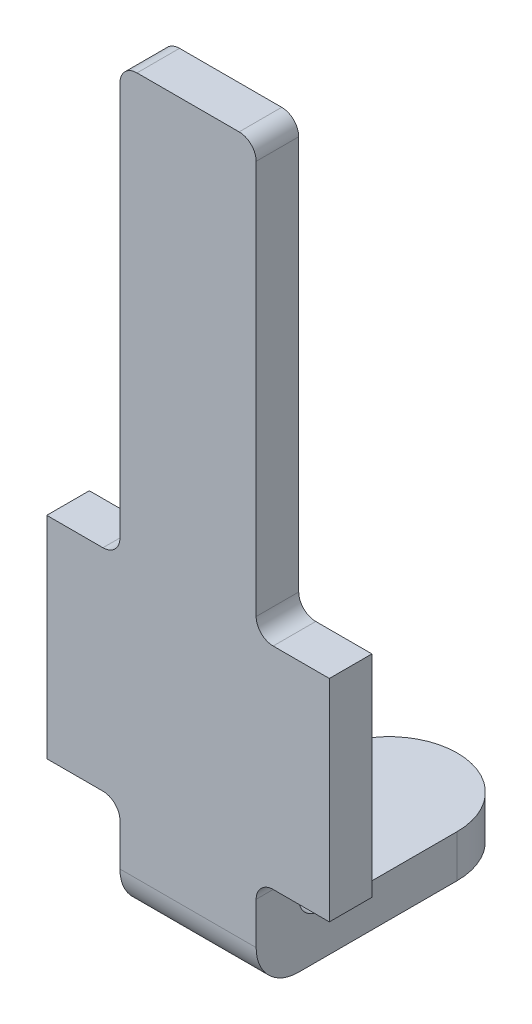
ISO-10303-21;
HEADER;
FILE_DESCRIPTION(('STEP AP214'),'2;1');
FILE_NAME('part.step','',(''),(''),'','','');
FILE_SCHEMA(('AUTOMOTIVE_DESIGN { 1 0 10303 214 1 1 1 1 }'));
ENDSEC;
DATA;
#1=APPLICATION_CONTEXT('core data for automotive mechanical design processes');
#2=APPLICATION_PROTOCOL_DEFINITION('international standard','automotive_design',2000,#1);
#3=PRODUCT_CONTEXT('',#1,'mechanical');
#4=PRODUCT('Part','Part','',(#3));
#5=PRODUCT_RELATED_PRODUCT_CATEGORY('part','',(#4));
#6=PRODUCT_DEFINITION_FORMATION('','',#4);
#7=PRODUCT_DEFINITION_CONTEXT('part definition',#1,'design');
#8=PRODUCT_DEFINITION('design','',#6,#7);
#9=PRODUCT_DEFINITION_SHAPE('','',#8);
#10=(LENGTH_UNIT() NAMED_UNIT(*) SI_UNIT(.MILLI.,.METRE.));
#11=(NAMED_UNIT(*) PLANE_ANGLE_UNIT() SI_UNIT($,.RADIAN.));
#12=(NAMED_UNIT(*) SI_UNIT($,.STERADIAN.) SOLID_ANGLE_UNIT());
#13=UNCERTAINTY_MEASURE_WITH_UNIT(LENGTH_MEASURE(1.E-05),#10,'distance_accuracy_value','');
#14=(GEOMETRIC_REPRESENTATION_CONTEXT(3) GLOBAL_UNCERTAINTY_ASSIGNED_CONTEXT((#13)) GLOBAL_UNIT_ASSIGNED_CONTEXT((#10,
#11,#12)) REPRESENTATION_CONTEXT('',''));
#15=CARTESIAN_POINT('',(0.,0.,0.));
#16=DIRECTION('',(0.,0.,1.));
#17=DIRECTION('',(1.,0.,0.));
#18=AXIS2_PLACEMENT_3D('',#15,#16,#17);
#19=CARTESIAN_POINT('',(-14.47,1.48437551370885,-0.748999999999983));
#20=DIRECTION('',(0.,0.,-1.));
#21=DIRECTION('',(1.,0.,0.));
#22=AXIS2_PLACEMENT_3D('',#19,#20,#21);
#23=CYLINDRICAL_SURFACE('',#22,0.1);
#24=CARTESIAN_POINT('',(-14.47,1.48437551370885,-0.498999999999983));
#25=DIRECTION('',(0.,0.,1.));
#26=DIRECTION('',(1.,0.,0.));
#27=AXIS2_PLACEMENT_3D('',#24,#25,#26);
#28=CIRCLE('',#27,0.1);
#29=CARTESIAN_POINT('',(-14.47,1.38437551370885,-0.499000000000012));
#30=VERTEX_POINT('',#29);
#31=CARTESIAN_POINT('',(-14.37,1.48437551370885,-0.498999999999983));
#32=VERTEX_POINT('',#31);
#33=EDGE_CURVE('E186',#30,#32,#28,.T.);
#34=ORIENTED_EDGE('',*,*,#33,.T.);
#35=DIRECTION('',(0.,0.,-1.));
#36=VECTOR('',#35,1.);
#37=CARTESIAN_POINT('',(-14.37,1.48437551370885,-0.748999999999983));
#38=LINE('',#37,#36);
#39=CARTESIAN_POINT('',(-14.37,1.48437551370885,-0.748999999999983));
#40=VERTEX_POINT('',#39);
#41=EDGE_CURVE('E190',#32,#40,#38,.T.);
#42=ORIENTED_EDGE('',*,*,#41,.T.);
#43=CARTESIAN_POINT('',(-14.47,1.48437551370885,-0.748999999999983));
#44=DIRECTION('',(0.,0.,-1.));
#45=DIRECTION('',(-1.,0.,0.));
#46=AXIS2_PLACEMENT_3D('',#43,#44,#45);
#47=CIRCLE('',#46,0.1);
#48=CARTESIAN_POINT('',(-14.47,1.38437551370885,-0.749000000000012));
#49=VERTEX_POINT('',#48);
#50=EDGE_CURVE('E272',#40,#49,#47,.T.);
#51=ORIENTED_EDGE('',*,*,#50,.T.);
#52=DIRECTION('',(0.,0.,1.));
#53=VECTOR('',#52,1.);
#54=CARTESIAN_POINT('',(-14.47,1.38437551370885,-0.749000000000012));
#55=LINE('',#54,#53);
#56=EDGE_CURVE('E194',#49,#30,#55,.T.);
#57=ORIENTED_EDGE('',*,*,#56,.T.);
#58=EDGE_LOOP('',(#34,#42,#51,#57));
#59=FACE_BOUND('',#58,.T.);
#60=ADVANCED_FACE('F16',(#59),#23,.F.);
#61=CARTESIAN_POINT('',(-13.47,1.48437551370885,-0.749000000000014));
#62=DIRECTION('',(0.,0.,1.));
#63=DIRECTION('',(-1.,0.,0.));
#64=AXIS2_PLACEMENT_3D('',#61,#62,#63);
#65=CYLINDRICAL_SURFACE('',#64,0.1);
#66=CARTESIAN_POINT('',(-13.47,1.48437551370885,-0.498999999999985));
#67=DIRECTION('',(0.,0.,1.));
#68=DIRECTION('',(1.,0.,0.));
#69=AXIS2_PLACEMENT_3D('',#66,#67,#68);
#70=CIRCLE('',#69,0.1);
#71=CARTESIAN_POINT('',(-13.57,1.48437551370885,-0.498999999999984));
#72=VERTEX_POINT('',#71);
#73=CARTESIAN_POINT('',(-13.47,1.38437551370885,-0.499000000000013));
#74=VERTEX_POINT('',#73);
#75=EDGE_CURVE('E229',#72,#74,#70,.T.);
#76=ORIENTED_EDGE('',*,*,#75,.T.);
#77=DIRECTION('',(0.,0.,-1.));
#78=VECTOR('',#77,1.);
#79=CARTESIAN_POINT('',(-13.47,1.38437551370885,-0.748999999999984));
#80=LINE('',#79,#78);
#81=CARTESIAN_POINT('',(-13.47,1.38437551370885,-0.749000000000014));
#82=VERTEX_POINT('',#81);
#83=EDGE_CURVE('E42',#74,#82,#80,.T.);
#84=ORIENTED_EDGE('',*,*,#83,.T.);
#85=CARTESIAN_POINT('',(-13.47,1.48437551370885,-0.748999999999984));
#86=DIRECTION('',(0.,0.,-1.));
#87=DIRECTION('',(-1.,0.,0.));
#88=AXIS2_PLACEMENT_3D('',#85,#86,#87);
#89=CIRCLE('',#88,0.1);
#90=CARTESIAN_POINT('',(-13.57,1.48437551370885,-0.748999999999984));
#91=VERTEX_POINT('',#90);
#92=EDGE_CURVE('E298',#82,#91,#89,.T.);
#93=ORIENTED_EDGE('',*,*,#92,.T.);
#94=DIRECTION('',(0.,0.,1.));
#95=VECTOR('',#94,1.);
#96=CARTESIAN_POINT('',(-13.57,1.48437551370885,-0.498999999999984));
#97=LINE('',#96,#95);
#98=EDGE_CURVE('E237',#91,#72,#97,.T.);
#99=ORIENTED_EDGE('',*,*,#98,.T.);
#100=EDGE_LOOP('',(#76,#84,#93,#99));
#101=FACE_BOUND('',#100,.T.);
#102=ADVANCED_FACE('F684',(#101),#65,.F.);
#103=CARTESIAN_POINT('',(-14.47,0.0459658151929143,-0.749000000000012));
#104=DIRECTION('',(0.,0.,1.));
#105=DIRECTION('',(-1.,0.,0.));
#106=AXIS2_PLACEMENT_3D('',#103,#104,#105);
#107=CYLINDRICAL_SURFACE('',#106,0.1);
#108=CARTESIAN_POINT('',(-14.47,0.0459658151929143,-0.498999999999983));
#109=DIRECTION('',(0.,0.,1.));
#110=DIRECTION('',(1.,0.,0.));
#111=AXIS2_PLACEMENT_3D('',#108,#109,#110);
#112=CIRCLE('',#111,0.1);
#113=CARTESIAN_POINT('',(-14.37,0.0459658151929143,-0.498999999999983));
#114=VERTEX_POINT('',#113);
#115=CARTESIAN_POINT('',(-14.47,0.145965815192914,-0.499000000000012));
#116=VERTEX_POINT('',#115);
#117=EDGE_CURVE('E259',#114,#116,#112,.T.);
#118=ORIENTED_EDGE('',*,*,#117,.T.);
#119=DIRECTION('',(0.,0.,-1.));
#120=VECTOR('',#119,1.);
#121=CARTESIAN_POINT('',(-14.47,0.145965815192914,-0.748999999999983));
#122=LINE('',#121,#120);
#123=CARTESIAN_POINT('',(-14.47,0.145965815192914,-0.749000000000012));
#124=VERTEX_POINT('',#123);
#125=EDGE_CURVE('E135',#116,#124,#122,.T.);
#126=ORIENTED_EDGE('',*,*,#125,.T.);
#127=CARTESIAN_POINT('',(-14.47,0.0459658151929143,-0.748999999999983));
#128=DIRECTION('',(0.,0.,-1.));
#129=DIRECTION('',(-1.,0.,0.));
#130=AXIS2_PLACEMENT_3D('',#127,#128,#129);
#131=CIRCLE('',#130,0.1);
#132=CARTESIAN_POINT('',(-14.37,0.0459658151929143,-0.748999999999983));
#133=VERTEX_POINT('',#132);
#134=EDGE_CURVE('E242',#124,#133,#131,.T.);
#135=ORIENTED_EDGE('',*,*,#134,.T.);
#136=DIRECTION('',(0.,0.,1.));
#137=VECTOR('',#136,1.);
#138=CARTESIAN_POINT('',(-14.37,0.0459658151929143,-0.499000000000012));
#139=LINE('',#138,#137);
#140=EDGE_CURVE('E120',#133,#114,#139,.T.);
#141=ORIENTED_EDGE('',*,*,#140,.T.);
#142=EDGE_LOOP('',(#118,#126,#135,#141));
#143=FACE_BOUND('',#142,.T.);
#144=ADVANCED_FACE('F459',(#143),#107,.F.);
#145=CARTESIAN_POINT('',(-13.47,0.0459658151929143,-0.748999999999984));
#146=DIRECTION('',(0.,0.,-1.));
#147=DIRECTION('',(1.,0.,0.));
#148=AXIS2_PLACEMENT_3D('',#145,#146,#147);
#149=CYLINDRICAL_SURFACE('',#148,0.1);
#150=CARTESIAN_POINT('',(-13.47,0.0459658151929143,-0.498999999999984));
#151=DIRECTION('',(0.,0.,1.));
#152=DIRECTION('',(1.,0.,0.));
#153=AXIS2_PLACEMENT_3D('',#150,#151,#152);
#154=CIRCLE('',#153,0.1);
#155=CARTESIAN_POINT('',(-13.47,0.145965815192914,-0.499000000000013));
#156=VERTEX_POINT('',#155);
#157=CARTESIAN_POINT('',(-13.57,0.0459658151929143,-0.498999999999984));
#158=VERTEX_POINT('',#157);
#159=EDGE_CURVE('E327',#156,#158,#154,.T.);
#160=ORIENTED_EDGE('',*,*,#159,.T.);
#161=DIRECTION('',(0.,0.,-1.));
#162=VECTOR('',#161,1.);
#163=CARTESIAN_POINT('',(-13.57,0.0459658151929143,-0.748999999999984));
#164=LINE('',#163,#162);
#165=CARTESIAN_POINT('',(-13.57,0.0459658151929143,-0.748999999999984));
#166=VERTEX_POINT('',#165);
#167=EDGE_CURVE('E232',#158,#166,#164,.T.);
#168=ORIENTED_EDGE('',*,*,#167,.T.);
#169=CARTESIAN_POINT('',(-13.47,0.0459658151929143,-0.748999999999984));
#170=DIRECTION('',(0.,0.,-1.));
#171=DIRECTION('',(-1.,0.,0.));
#172=AXIS2_PLACEMENT_3D('',#169,#170,#171);
#173=CIRCLE('',#172,0.1);
#174=CARTESIAN_POINT('',(-13.47,0.145965815192914,-0.749000000000013));
#175=VERTEX_POINT('',#174);
#176=EDGE_CURVE('E266',#166,#175,#173,.T.);
#177=ORIENTED_EDGE('',*,*,#176,.T.);
#178=DIRECTION('',(0.,0.,1.));
#179=VECTOR('',#178,1.);
#180=CARTESIAN_POINT('',(-13.47,0.145965815192914,-0.749000000000013));
#181=LINE('',#180,#179);
#182=EDGE_CURVE('E11',#175,#156,#181,.T.);
#183=ORIENTED_EDGE('',*,*,#182,.T.);
#184=EDGE_LOOP('',(#160,#168,#177,#183));
#185=FACE_BOUND('',#184,.T.);
#186=ADVANCED_FACE('F519',(#185),#149,.F.);
#187=CARTESIAN_POINT('',(-14.27,3.8,-0.748999999999983));
#188=DIRECTION('',(0.,0.,1.));
#189=DIRECTION('',(-1.,0.,0.));
#190=AXIS2_PLACEMENT_3D('',#187,#188,#189);
#191=CYLINDRICAL_SURFACE('',#190,0.1);
#192=CARTESIAN_POINT('',(-14.27,3.8,-0.498999999999984));
#193=DIRECTION('',(0.,0.,-1.));
#194=DIRECTION('',(1.,0.,0.));
#195=AXIS2_PLACEMENT_3D('',#192,#193,#194);
#196=CIRCLE('',#195,0.1);
#197=CARTESIAN_POINT('',(-14.37,3.8,-0.498999999999984));
#198=VERTEX_POINT('',#197);
#199=CARTESIAN_POINT('',(-14.27,3.9,-0.498999999999984));
#200=VERTEX_POINT('',#199);
#201=EDGE_CURVE('E200',#198,#200,#196,.T.);
#202=ORIENTED_EDGE('',*,*,#201,.T.);
#203=DIRECTION('',(0.,0.,-1.));
#204=VECTOR('',#203,1.);
#205=CARTESIAN_POINT('',(-14.27,3.9,-0.748999999999983));
#206=LINE('',#205,#204);
#207=CARTESIAN_POINT('',(-14.27,3.9,-0.748999999999983));
#208=VERTEX_POINT('',#207);
#209=EDGE_CURVE('E312',#200,#208,#206,.T.);
#210=ORIENTED_EDGE('',*,*,#209,.T.);
#211=CARTESIAN_POINT('',(-14.27,3.8,-0.748999999999983));
#212=DIRECTION('',(0.,0.,1.));
#213=DIRECTION('',(-1.,0.,0.));
#214=AXIS2_PLACEMENT_3D('',#211,#212,#213);
#215=CIRCLE('',#214,0.1);
#216=CARTESIAN_POINT('',(-14.37,3.8,-0.748999999999983));
#217=VERTEX_POINT('',#216);
#218=EDGE_CURVE('E268',#208,#217,#215,.T.);
#219=ORIENTED_EDGE('',*,*,#218,.T.);
#220=DIRECTION('',(0.,0.,1.));
#221=VECTOR('',#220,1.);
#222=CARTESIAN_POINT('',(-14.37,3.8,-0.498999999999984));
#223=LINE('',#222,#221);
#224=EDGE_CURVE('E209',#217,#198,#223,.T.);
#225=ORIENTED_EDGE('',*,*,#224,.T.);
#226=EDGE_LOOP('',(#202,#210,#219,#225));
#227=FACE_BOUND('',#226,.T.);
#228=ADVANCED_FACE('F693',(#227),#191,.T.);
#229=CARTESIAN_POINT('',(-13.67,3.8,-0.748999999999984));
#230=DIRECTION('',(0.,0.,-1.));
#231=DIRECTION('',(1.,0.,0.));
#232=AXIS2_PLACEMENT_3D('',#229,#230,#231);
#233=CYLINDRICAL_SURFACE('',#232,0.1);
#234=CARTESIAN_POINT('',(-13.67,3.8,-0.498999999999985));
#235=DIRECTION('',(0.,0.,-1.));
#236=DIRECTION('',(1.,0.,0.));
#237=AXIS2_PLACEMENT_3D('',#234,#235,#236);
#238=CIRCLE('',#237,0.1);
#239=CARTESIAN_POINT('',(-13.67,3.9,-0.498999999999985));
#240=VERTEX_POINT('',#239);
#241=CARTESIAN_POINT('',(-13.57,3.8,-0.498999999999985));
#242=VERTEX_POINT('',#241);
#243=EDGE_CURVE('E226',#240,#242,#238,.T.);
#244=ORIENTED_EDGE('',*,*,#243,.T.);
#245=DIRECTION('',(0.,0.,-1.));
#246=VECTOR('',#245,1.);
#247=CARTESIAN_POINT('',(-13.57,3.8,-0.748999999999984));
#248=LINE('',#247,#246);
#249=CARTESIAN_POINT('',(-13.57,3.8,-0.748999999999984));
#250=VERTEX_POINT('',#249);
#251=EDGE_CURVE('E221',#242,#250,#248,.T.);
#252=ORIENTED_EDGE('',*,*,#251,.T.);
#253=CARTESIAN_POINT('',(-13.67,3.8,-0.748999999999984));
#254=DIRECTION('',(0.,0.,1.));
#255=DIRECTION('',(-1.,0.,0.));
#256=AXIS2_PLACEMENT_3D('',#253,#254,#255);
#257=CIRCLE('',#256,0.1);
#258=CARTESIAN_POINT('',(-13.67,3.9,-0.748999999999984));
#259=VERTEX_POINT('',#258);
#260=EDGE_CURVE('E271',#250,#259,#257,.T.);
#261=ORIENTED_EDGE('',*,*,#260,.T.);
#262=DIRECTION('',(0.,0.,1.));
#263=VECTOR('',#262,1.);
#264=CARTESIAN_POINT('',(-13.67,3.9,-0.748999999999984));
#265=LINE('',#264,#263);
#266=EDGE_CURVE('E302',#259,#240,#265,.T.);
#267=ORIENTED_EDGE('',*,*,#266,.T.);
#268=EDGE_LOOP('',(#244,#252,#261,#267));
#269=FACE_BOUND('',#268,.T.);
#270=ADVANCED_FACE('F688',(#269),#233,.T.);
#271=CARTESIAN_POINT('',(-13.14,0.,-1.00308650274883E-13));
#272=DIRECTION('',(-1.,0.,0.));
#273=DIRECTION('',(0.,1.,0.));
#274=AXIS2_PLACEMENT_3D('',#271,#272,#273);
#275=PLANE('',#274);
#276=DIRECTION('',(0.,0.,1.));
#277=VECTOR('',#276,1.);
#278=CARTESIAN_POINT('',(-13.14,1.38437551370885,-0.749000000000014));
#279=LINE('',#278,#277);
#280=CARTESIAN_POINT('',(-13.14,1.38437551370885,-0.749000000000014));
#281=VERTEX_POINT('',#280);
#282=CARTESIAN_POINT('',(-13.14,1.38437551370885,-0.499000000000014));
#283=VERTEX_POINT('',#282);
#284=EDGE_CURVE('E262',#281,#283,#279,.T.);
#285=ORIENTED_EDGE('',*,*,#284,.T.);
#286=DIRECTION('',(0.,-1.,0.));
#287=VECTOR('',#286,1.);
#288=CARTESIAN_POINT('',(-13.14,1.38437551370885,-0.499000000000014));
#289=LINE('',#288,#287);
#290=CARTESIAN_POINT('',(-13.14,0.145965815192914,-0.499000000000014));
#291=VERTEX_POINT('',#290);
#292=EDGE_CURVE('E379',#283,#291,#289,.T.);
#293=ORIENTED_EDGE('',*,*,#292,.T.);
#294=DIRECTION('',(0.,0.,1.));
#295=VECTOR('',#294,1.);
#296=CARTESIAN_POINT('',(-13.14,0.145965815192914,-0.749000000000014));
#297=LINE('',#296,#295);
#298=CARTESIAN_POINT('',(-13.14,0.145965815192914,-0.749000000000014));
#299=VERTEX_POINT('',#298);
#300=EDGE_CURVE('E27',#299,#291,#297,.T.);
#301=ORIENTED_EDGE('',*,*,#300,.F.);
#302=DIRECTION('',(0.,-1.,0.));
#303=VECTOR('',#302,1.);
#304=CARTESIAN_POINT('',(-13.14,1.38437551370885,-0.749000000000014));
#305=LINE('',#304,#303);
#306=EDGE_CURVE('E267',#281,#299,#305,.T.);
#307=ORIENTED_EDGE('',*,*,#306,.F.);
#308=EDGE_LOOP('',(#285,#293,#301,#307));
#309=FACE_BOUND('',#308,.T.);
#310=ADVANCED_FACE('F692',(#309),#275,.F.);
#311=CARTESIAN_POINT('',(-14.8,0.145965815192914,-0.749000000000011));
#312=DIRECTION('',(0.,-1.,0.));
#313=DIRECTION('',(0.,0.,-1.));
#314=AXIS2_PLACEMENT_3D('',#311,#312,#313);
#315=PLANE('',#314);
#316=DIRECTION('',(1.,0.,0.));
#317=VECTOR('',#316,1.);
#318=CARTESIAN_POINT('',(-14.8,0.145965815192914,-0.749000000000011));
#319=LINE('',#318,#317);
#320=EDGE_CURVE('E263',#175,#299,#319,.T.);
#321=ORIENTED_EDGE('',*,*,#320,.T.);
#322=ORIENTED_EDGE('',*,*,#300,.T.);
#323=DIRECTION('',(1.,0.,0.));
#324=VECTOR('',#323,1.);
#325=CARTESIAN_POINT('',(-14.8,0.145965815192914,-0.499000000000011));
#326=LINE('',#325,#324);
#327=EDGE_CURVE('E331',#156,#291,#326,.T.);
#328=ORIENTED_EDGE('',*,*,#327,.F.);
#329=ORIENTED_EDGE('',*,*,#182,.F.);
#330=EDGE_LOOP('',(#321,#322,#328,#329));
#331=FACE_BOUND('',#330,.T.);
#332=ADVANCED_FACE('F525',(#331),#315,.T.);
#333=CARTESIAN_POINT('',(-14.8,1.38437551370885,-0.749000000000012));
#334=DIRECTION('',(0.,-1.,0.));
#335=DIRECTION('',(0.,0.,-1.));
#336=AXIS2_PLACEMENT_3D('',#333,#334,#335);
#337=PLANE('',#336);
#338=DIRECTION('',(1.,0.,0.));
#339=VECTOR('',#338,1.);
#340=CARTESIAN_POINT('',(-14.8,1.38437551370885,-0.499000000000011));
#341=LINE('',#340,#339);
#342=EDGE_CURVE('E376',#74,#283,#341,.T.);
#343=ORIENTED_EDGE('',*,*,#342,.T.);
#344=ORIENTED_EDGE('',*,*,#284,.F.);
#345=DIRECTION('',(1.,0.,0.));
#346=VECTOR('',#345,1.);
#347=CARTESIAN_POINT('',(-14.8,1.38437551370885,-0.749000000000012));
#348=LINE('',#347,#346);
#349=EDGE_CURVE('E301',#82,#281,#348,.T.);
#350=ORIENTED_EDGE('',*,*,#349,.F.);
#351=ORIENTED_EDGE('',*,*,#83,.F.);
#352=EDGE_LOOP('',(#343,#344,#350,#351));
#353=FACE_BOUND('',#352,.T.);
#354=ADVANCED_FACE('F771',(#353),#337,.F.);
#355=CARTESIAN_POINT('',(-14.8,1.38437551370885,-0.749000000000012));
#356=DIRECTION('',(0.,-1.,0.));
#357=DIRECTION('',(0.,0.,-1.));
#358=AXIS2_PLACEMENT_3D('',#355,#356,#357);
#359=PLANE('',#358);
#360=DIRECTION('',(1.,0.,0.));
#361=VECTOR('',#360,1.);
#362=CARTESIAN_POINT('',(-14.8,1.38437551370885,-0.749000000000012));
#363=LINE('',#362,#361);
#364=CARTESIAN_POINT('',(-14.8,1.38437551370885,-0.749000000000012));
#365=VERTEX_POINT('',#364);
#366=EDGE_CURVE('E283',#365,#49,#363,.T.);
#367=ORIENTED_EDGE('',*,*,#366,.F.);
#368=DIRECTION('',(0.,0.,1.));
#369=VECTOR('',#368,1.);
#370=CARTESIAN_POINT('',(-14.8,1.38437551370885,-0.749000000000012));
#371=LINE('',#370,#369);
#372=CARTESIAN_POINT('',(-14.8,1.38437551370885,-0.499000000000011));
#373=VERTEX_POINT('',#372);
#374=EDGE_CURVE('E384',#365,#373,#371,.T.);
#375=ORIENTED_EDGE('',*,*,#374,.T.);
#376=DIRECTION('',(1.,0.,0.));
#377=VECTOR('',#376,1.);
#378=CARTESIAN_POINT('',(-14.8,1.38437551370885,-0.499000000000011));
#379=LINE('',#378,#377);
#380=EDGE_CURVE('E199',#373,#30,#379,.T.);
#381=ORIENTED_EDGE('',*,*,#380,.T.);
#382=ORIENTED_EDGE('',*,*,#56,.F.);
#383=EDGE_LOOP('',(#367,#375,#381,#382));
#384=FACE_BOUND('',#383,.T.);
#385=ADVANCED_FACE('F471',(#384),#359,.F.);
#386=CARTESIAN_POINT('',(-14.8,0.145965815192914,-0.749000000000011));
#387=DIRECTION('',(0.,-1.,0.));
#388=DIRECTION('',(0.,0.,-1.));
#389=AXIS2_PLACEMENT_3D('',#386,#387,#388);
#390=PLANE('',#389);
#391=DIRECTION('',(1.,0.,0.));
#392=VECTOR('',#391,1.);
#393=CARTESIAN_POINT('',(-14.8,0.145965815192914,-0.499000000000011));
#394=LINE('',#393,#392);
#395=CARTESIAN_POINT('',(-14.8,0.145965815192914,-0.499000000000011));
#396=VERTEX_POINT('',#395);
#397=EDGE_CURVE('E303',#396,#116,#394,.T.);
#398=ORIENTED_EDGE('',*,*,#397,.F.);
#399=DIRECTION('',(0.,0.,1.));
#400=VECTOR('',#399,1.);
#401=CARTESIAN_POINT('',(-14.8,0.145965815192914,-0.749000000000011));
#402=LINE('',#401,#400);
#403=CARTESIAN_POINT('',(-14.8,0.145965815192914,-0.749000000000011));
#404=VERTEX_POINT('',#403);
#405=EDGE_CURVE('E20',#404,#396,#402,.T.);
#406=ORIENTED_EDGE('',*,*,#405,.F.);
#407=DIRECTION('',(1.,0.,0.));
#408=VECTOR('',#407,1.);
#409=CARTESIAN_POINT('',(-14.8,0.145965815192914,-0.749000000000011));
#410=LINE('',#409,#408);
#411=EDGE_CURVE('E238',#404,#124,#410,.T.);
#412=ORIENTED_EDGE('',*,*,#411,.T.);
#413=ORIENTED_EDGE('',*,*,#125,.F.);
#414=EDGE_LOOP('',(#398,#406,#412,#413));
#415=FACE_BOUND('',#414,.T.);
#416=ADVANCED_FACE('F465',(#415),#390,.T.);
#417=CARTESIAN_POINT('',(-14.8,0.,0.));
#418=DIRECTION('',(-1.,0.,0.));
#419=DIRECTION('',(0.,1.,0.));
#420=AXIS2_PLACEMENT_3D('',#417,#418,#419);
#421=PLANE('',#420);
#422=ORIENTED_EDGE('',*,*,#374,.F.);
#423=DIRECTION('',(0.,-1.,0.));
#424=VECTOR('',#423,1.);
#425=CARTESIAN_POINT('',(-14.8,1.38437551370885,-0.749000000000012));
#426=LINE('',#425,#424);
#427=EDGE_CURVE('E241',#365,#404,#426,.T.);
#428=ORIENTED_EDGE('',*,*,#427,.T.);
#429=ORIENTED_EDGE('',*,*,#405,.T.);
#430=DIRECTION('',(0.,-1.,0.));
#431=VECTOR('',#430,1.);
#432=CARTESIAN_POINT('',(-14.8,1.38437551370885,-0.499000000000011));
#433=LINE('',#432,#431);
#434=EDGE_CURVE('E307',#373,#396,#433,.T.);
#435=ORIENTED_EDGE('',*,*,#434,.F.);
#436=EDGE_LOOP('',(#422,#428,#429,#435));
#437=FACE_BOUND('',#436,.T.);
#438=ADVANCED_FACE('F468',(#437),#421,.T.);
#439=CARTESIAN_POINT('',(-13.97,-0.2,-1.68));
#440=DIRECTION('',(0.,-1.,0.));
#441=DIRECTION('',(0.,0.,1.));
#442=AXIS2_PLACEMENT_3D('',#439,#440,#441);
#443=CYLINDRICAL_SURFACE('',#442,0.4);
#444=DIRECTION('',(0.,-1.,0.));
#445=VECTOR('',#444,1.);
#446=CARTESIAN_POINT('',(-13.57,-0.2,-1.68));
#447=LINE('',#446,#445);
#448=CARTESIAN_POINT('',(-13.57,-0.2,-1.68));
#449=VERTEX_POINT('',#448);
#450=CARTESIAN_POINT('',(-13.57,-0.45,-1.68));
#451=VERTEX_POINT('',#450);
#452=EDGE_CURVE('E84',#449,#451,#447,.T.);
#453=ORIENTED_EDGE('',*,*,#452,.T.);
#454=CARTESIAN_POINT('',(-13.97,-0.45,-1.68));
#455=DIRECTION('',(0.,1.,0.));
#456=DIRECTION('',(0.,0.,-1.));
#457=AXIS2_PLACEMENT_3D('',#454,#455,#456);
#458=CIRCLE('',#457,0.4);
#459=CARTESIAN_POINT('',(-14.37,-0.45,-1.68));
#460=VERTEX_POINT('',#459);
#461=EDGE_CURVE('E347',#451,#460,#458,.T.);
#462=ORIENTED_EDGE('',*,*,#461,.T.);
#463=DIRECTION('',(0.,1.,0.));
#464=VECTOR('',#463,1.);
#465=CARTESIAN_POINT('',(-14.37,-0.2,-1.68));
#466=LINE('',#465,#464);
#467=CARTESIAN_POINT('',(-14.37,-0.2,-1.68));
#468=VERTEX_POINT('',#467);
#469=EDGE_CURVE('E324',#460,#468,#466,.T.);
#470=ORIENTED_EDGE('',*,*,#469,.T.);
#471=CARTESIAN_POINT('',(-13.97,-0.2,-1.68));
#472=DIRECTION('',(0.,-1.,0.));
#473=DIRECTION('',(0.,0.,1.));
#474=AXIS2_PLACEMENT_3D('',#471,#472,#473);
#475=CIRCLE('',#474,0.4);
#476=EDGE_CURVE('E340',#468,#449,#475,.T.);
#477=ORIENTED_EDGE('',*,*,#476,.T.);
#478=EDGE_LOOP('',(#453,#462,#470,#477));
#479=FACE_BOUND('',#478,.T.);
#480=ADVANCED_FACE('F709',(#479),#443,.T.);
#481=CARTESIAN_POINT('',(-14.37,-0.2,-0.748999999999983));
#482=DIRECTION('',(-1.,0.,0.));
#483=DIRECTION('',(0.,1.,0.));
#484=AXIS2_PLACEMENT_3D('',#481,#482,#483);
#485=PLANE('',#484);
#486=DIRECTION('',(0.,-1.,0.));
#487=VECTOR('',#486,1.);
#488=CARTESIAN_POINT('',(-14.37,3.9,-0.748999999999983));
#489=LINE('',#488,#487);
#490=CARTESIAN_POINT('',(-14.37,-0.0749999999999988,-0.748999999999983));
#491=VERTEX_POINT('',#490);
#492=EDGE_CURVE('E363',#133,#491,#489,.T.);
#493=ORIENTED_EDGE('',*,*,#492,.T.);
#494=CARTESIAN_POINT('',(-14.37,-0.0749999999999988,-0.873999999999983));
#495=DIRECTION('',(1.,0.,0.));
#496=DIRECTION('',(0.,0.,-1.));
#497=AXIS2_PLACEMENT_3D('',#494,#495,#496);
#498=CIRCLE('',#497,0.125);
#499=CARTESIAN_POINT('',(-14.37,-0.2,-0.873999999999983));
#500=VERTEX_POINT('',#499);
#501=EDGE_CURVE('E280',#491,#500,#498,.T.);
#502=ORIENTED_EDGE('',*,*,#501,.T.);
#503=DIRECTION('',(0.,0.,-1.));
#504=VECTOR('',#503,1.);
#505=CARTESIAN_POINT('',(-14.37,-0.2,-0.873999999999983));
#506=LINE('',#505,#504);
#507=EDGE_CURVE('E253',#500,#468,#506,.T.);
#508=ORIENTED_EDGE('',*,*,#507,.T.);
#509=ORIENTED_EDGE('',*,*,#469,.F.);
#510=DIRECTION('',(0.,0.,1.));
#511=VECTOR('',#510,1.);
#512=CARTESIAN_POINT('',(-14.37,-0.45,-0.748999999999983));
#513=LINE('',#512,#511);
#514=CARTESIAN_POINT('',(-14.37,-0.45,-0.748999999999983));
#515=VERTEX_POINT('',#514);
#516=EDGE_CURVE('E371',#460,#515,#513,.T.);
#517=ORIENTED_EDGE('',*,*,#516,.T.);
#518=CARTESIAN_POINT('',(-14.37,-0.2,-0.748999999999983));
#519=DIRECTION('',(-1.,0.,0.));
#520=DIRECTION('',(0.,0.,-1.));
#521=AXIS2_PLACEMENT_3D('',#518,#519,#520);
#522=CIRCLE('',#521,0.25);
#523=CARTESIAN_POINT('',(-14.37,-0.2,-0.498999999999983));
#524=VERTEX_POINT('',#523);
#525=EDGE_CURVE('E248',#515,#524,#522,.T.);
#526=ORIENTED_EDGE('',*,*,#525,.T.);
#527=DIRECTION('',(0.,1.,0.));
#528=VECTOR('',#527,1.);
#529=CARTESIAN_POINT('',(-14.37,3.9,-0.498999999999984));
#530=LINE('',#529,#528);
#531=EDGE_CURVE('E255',#524,#114,#530,.T.);
#532=ORIENTED_EDGE('',*,*,#531,.T.);
#533=ORIENTED_EDGE('',*,*,#140,.F.);
#534=EDGE_LOOP('',(#493,#502,#508,#509,#517,#526,#532,#533));
#535=FACE_BOUND('',#534,.T.);
#536=ADVANCED_FACE('F454',(#535),#485,.T.);
#537=CARTESIAN_POINT('',(-13.57,-0.2,-0.748999999999984));
#538=DIRECTION('',(-1.,0.,0.));
#539=DIRECTION('',(0.,1.,0.));
#540=AXIS2_PLACEMENT_3D('',#537,#538,#539);
#541=PLANE('',#540);
#542=DIRECTION('',(0.,1.,0.));
#543=VECTOR('',#542,1.);
#544=CARTESIAN_POINT('',(-13.57,3.9,-0.498999999999985));
#545=LINE('',#544,#543);
#546=CARTESIAN_POINT('',(-13.57,-0.2,-0.498999999999984));
#547=VERTEX_POINT('',#546);
#548=EDGE_CURVE('E258',#547,#158,#545,.T.);
#549=ORIENTED_EDGE('',*,*,#548,.F.);
#550=CARTESIAN_POINT('',(-13.57,-0.2,-0.748999999999984));
#551=DIRECTION('',(-1.,0.,0.));
#552=DIRECTION('',(0.,0.,-1.));
#553=AXIS2_PLACEMENT_3D('',#550,#551,#552);
#554=CIRCLE('',#553,0.25);
#555=CARTESIAN_POINT('',(-13.57,-0.45,-0.748999999999984));
#556=VERTEX_POINT('',#555);
#557=EDGE_CURVE('E243',#556,#547,#554,.T.);
#558=ORIENTED_EDGE('',*,*,#557,.F.);
#559=DIRECTION('',(0.,0.,1.));
#560=VECTOR('',#559,1.);
#561=CARTESIAN_POINT('',(-13.57,-0.45,-0.748999999999984));
#562=LINE('',#561,#560);
#563=EDGE_CURVE('E372',#451,#556,#562,.T.);
#564=ORIENTED_EDGE('',*,*,#563,.F.);
#565=ORIENTED_EDGE('',*,*,#452,.F.);
#566=DIRECTION('',(0.,0.,-1.));
#567=VECTOR('',#566,1.);
#568=CARTESIAN_POINT('',(-13.57,-0.2,-0.873999999999984));
#569=LINE('',#568,#567);
#570=CARTESIAN_POINT('',(-13.57,-0.2,-0.873999999999984));
#571=VERTEX_POINT('',#570);
#572=EDGE_CURVE('E337',#571,#449,#569,.T.);
#573=ORIENTED_EDGE('',*,*,#572,.F.);
#574=CARTESIAN_POINT('',(-13.57,-0.0749999999999988,-0.873999999999984));
#575=DIRECTION('',(1.,0.,0.));
#576=DIRECTION('',(0.,0.,-1.));
#577=AXIS2_PLACEMENT_3D('',#574,#575,#576);
#578=CIRCLE('',#577,0.125);
#579=CARTESIAN_POINT('',(-13.57,-0.0749999999999988,-0.748999999999984));
#580=VERTEX_POINT('',#579);
#581=EDGE_CURVE('E254',#580,#571,#578,.T.);
#582=ORIENTED_EDGE('',*,*,#581,.F.);
#583=DIRECTION('',(0.,-1.,0.));
#584=VECTOR('',#583,1.);
#585=CARTESIAN_POINT('',(-13.57,3.9,-0.748999999999984));
#586=LINE('',#585,#584);
#587=EDGE_CURVE('E418',#166,#580,#586,.T.);
#588=ORIENTED_EDGE('',*,*,#587,.F.);
#589=ORIENTED_EDGE('',*,*,#167,.F.);
#590=EDGE_LOOP('',(#549,#558,#564,#565,#573,#582,#588,#589));
#591=FACE_BOUND('',#590,.T.);
#592=ADVANCED_FACE('F523',(#591),#541,.F.);
#593=CARTESIAN_POINT('',(-13.57,3.9,-0.498999999999985));
#594=DIRECTION('',(0.,0.,-1.));
#595=DIRECTION('',(-1.,0.,0.));
#596=AXIS2_PLACEMENT_3D('',#593,#594,#595);
#597=PLANE('',#596);
#598=DIRECTION('',(-1.,0.,0.));
#599=VECTOR('',#598,1.);
#600=CARTESIAN_POINT('',(-13.57,3.9,-0.498999999999985));
#601=LINE('',#600,#599);
#602=EDGE_CURVE('E364',#240,#200,#601,.T.);
#603=ORIENTED_EDGE('',*,*,#602,.T.);
#604=ORIENTED_EDGE('',*,*,#201,.F.);
#605=DIRECTION('',(0.,1.,0.));
#606=VECTOR('',#605,1.);
#607=CARTESIAN_POINT('',(-14.37,3.9,-0.498999999999984));
#608=LINE('',#607,#606);
#609=EDGE_CURVE('E203',#32,#198,#608,.T.);
#610=ORIENTED_EDGE('',*,*,#609,.F.);
#611=ORIENTED_EDGE('',*,*,#33,.F.);
#612=ORIENTED_EDGE('',*,*,#380,.F.);
#613=ORIENTED_EDGE('',*,*,#434,.T.);
#614=ORIENTED_EDGE('',*,*,#397,.T.);
#615=ORIENTED_EDGE('',*,*,#117,.F.);
#616=ORIENTED_EDGE('',*,*,#531,.F.);
#617=DIRECTION('',(-1.,0.,0.));
#618=VECTOR('',#617,1.);
#619=CARTESIAN_POINT('',(-13.57,-0.2,-0.498999999999984));
#620=LINE('',#619,#618);
#621=EDGE_CURVE('E247',#547,#524,#620,.T.);
#622=ORIENTED_EDGE('',*,*,#621,.F.);
#623=ORIENTED_EDGE('',*,*,#548,.T.);
#624=ORIENTED_EDGE('',*,*,#159,.F.);
#625=ORIENTED_EDGE('',*,*,#327,.T.);
#626=ORIENTED_EDGE('',*,*,#292,.F.);
#627=ORIENTED_EDGE('',*,*,#342,.F.);
#628=ORIENTED_EDGE('',*,*,#75,.F.);
#629=DIRECTION('',(0.,1.,0.));
#630=VECTOR('',#629,1.);
#631=CARTESIAN_POINT('',(-13.57,3.9,-0.498999999999985));
#632=LINE('',#631,#630);
#633=EDGE_CURVE('E233',#72,#242,#632,.T.);
#634=ORIENTED_EDGE('',*,*,#633,.T.);
#635=ORIENTED_EDGE('',*,*,#243,.F.);
#636=EDGE_LOOP('',(#603,#604,#610,#611,#612,#613,#614,#615,#616,#622,#623,#624,#625,#626,#627,
#628,#634,#635));
#637=FACE_BOUND('',#636,.T.);
#638=ADVANCED_FACE('F18',(#637),#597,.F.);
#639=CARTESIAN_POINT('',(-13.57,-0.2,-0.748999999999984));
#640=DIRECTION('',(-1.,0.,0.));
#641=DIRECTION('',(0.,0.,-1.));
#642=AXIS2_PLACEMENT_3D('',#639,#640,#641);
#643=CYLINDRICAL_SURFACE('',#642,0.25);
#644=ORIENTED_EDGE('',*,*,#525,.F.);
#645=DIRECTION('',(-1.,0.,0.));
#646=VECTOR('',#645,1.);
#647=CARTESIAN_POINT('',(-13.57,-0.45,-0.748999999999984));
#648=LINE('',#647,#646);
#649=EDGE_CURVE('E367',#556,#515,#648,.T.);
#650=ORIENTED_EDGE('',*,*,#649,.F.);
#651=ORIENTED_EDGE('',*,*,#557,.T.);
#652=ORIENTED_EDGE('',*,*,#621,.T.);
#653=EDGE_LOOP('',(#644,#650,#651,#652));
#654=FACE_BOUND('',#653,.T.);
#655=ADVANCED_FACE('F677',(#654),#643,.T.);
#656=CARTESIAN_POINT('',(-13.57,-0.45,-0.748999999999984));
#657=DIRECTION('',(0.,1.,0.));
#658=DIRECTION('',(0.,0.,-1.));
#659=AXIS2_PLACEMENT_3D('',#656,#657,#658);
#660=PLANE('',#659);
#661=ORIENTED_EDGE('',*,*,#461,.F.);
#662=ORIENTED_EDGE('',*,*,#563,.T.);
#663=ORIENTED_EDGE('',*,*,#649,.T.);
#664=ORIENTED_EDGE('',*,*,#516,.F.);
#665=EDGE_LOOP('',(#661,#662,#663,#664));
#666=FACE_BOUND('',#665,.T.);
#667=ADVANCED_FACE('F739',(#666),#660,.F.);
#668=CARTESIAN_POINT('',(-13.57,-0.2,-0.873999999999984));
#669=DIRECTION('',(0.,-1.,0.));
#670=DIRECTION('',(-1.,0.,0.));
#671=AXIS2_PLACEMENT_3D('',#668,#669,#670);
#672=PLANE('',#671);
#673=ORIENTED_EDGE('',*,*,#507,.F.);
#674=DIRECTION('',(-1.,0.,0.));
#675=VECTOR('',#674,1.);
#676=CARTESIAN_POINT('',(-13.57,-0.2,-0.873999999999984));
#677=LINE('',#676,#675);
#678=EDGE_CURVE('E249',#571,#500,#677,.T.);
#679=ORIENTED_EDGE('',*,*,#678,.F.);
#680=ORIENTED_EDGE('',*,*,#572,.T.);
#681=ORIENTED_EDGE('',*,*,#476,.F.);
#682=EDGE_LOOP('',(#673,#679,#680,#681));
#683=FACE_BOUND('',#682,.T.);
#684=ADVANCED_FACE('F755',(#683),#672,.F.);
#685=CARTESIAN_POINT('',(-13.57,-0.0749999999999988,-0.873999999999984));
#686=DIRECTION('',(-1.,0.,0.));
#687=DIRECTION('',(0.,0.,-1.));
#688=AXIS2_PLACEMENT_3D('',#685,#686,#687);
#689=CYLINDRICAL_SURFACE('',#688,0.125);
#690=ORIENTED_EDGE('',*,*,#501,.F.);
#691=DIRECTION('',(-1.,0.,0.));
#692=VECTOR('',#691,1.);
#693=CARTESIAN_POINT('',(-13.57,-0.0749999999999988,-0.748999999999984));
#694=LINE('',#693,#692);
#695=EDGE_CURVE('E405',#580,#491,#694,.T.);
#696=ORIENTED_EDGE('',*,*,#695,.F.);
#697=ORIENTED_EDGE('',*,*,#581,.T.);
#698=ORIENTED_EDGE('',*,*,#678,.T.);
#699=EDGE_LOOP('',(#690,#696,#697,#698));
#700=FACE_BOUND('',#699,.T.);
#701=ADVANCED_FACE('F453',(#700),#689,.F.);
#702=CARTESIAN_POINT('',(-13.57,3.9,-0.748999999999984));
#703=DIRECTION('',(0.,0.,1.));
#704=DIRECTION('',(1.,0.,0.));
#705=AXIS2_PLACEMENT_3D('',#702,#703,#704);
#706=PLANE('',#705);
#707=DIRECTION('',(0.,-1.,0.));
#708=VECTOR('',#707,1.);
#709=CARTESIAN_POINT('',(-13.57,3.9,-0.748999999999984));
#710=LINE('',#709,#708);
#711=EDGE_CURVE('E295',#250,#91,#710,.T.);
#712=ORIENTED_EDGE('',*,*,#711,.T.);
#713=ORIENTED_EDGE('',*,*,#92,.F.);
#714=ORIENTED_EDGE('',*,*,#349,.T.);
#715=ORIENTED_EDGE('',*,*,#306,.T.);
#716=ORIENTED_EDGE('',*,*,#320,.F.);
#717=ORIENTED_EDGE('',*,*,#176,.F.);
#718=ORIENTED_EDGE('',*,*,#587,.T.);
#719=ORIENTED_EDGE('',*,*,#695,.T.);
#720=ORIENTED_EDGE('',*,*,#492,.F.);
#721=ORIENTED_EDGE('',*,*,#134,.F.);
#722=ORIENTED_EDGE('',*,*,#411,.F.);
#723=ORIENTED_EDGE('',*,*,#427,.F.);
#724=ORIENTED_EDGE('',*,*,#366,.T.);
#725=ORIENTED_EDGE('',*,*,#50,.F.);
#726=DIRECTION('',(0.,-1.,0.));
#727=VECTOR('',#726,1.);
#728=CARTESIAN_POINT('',(-14.37,3.9,-0.748999999999983));
#729=LINE('',#728,#727);
#730=EDGE_CURVE('E213',#217,#40,#729,.T.);
#731=ORIENTED_EDGE('',*,*,#730,.F.);
#732=ORIENTED_EDGE('',*,*,#218,.F.);
#733=DIRECTION('',(-1.,0.,0.));
#734=VECTOR('',#733,1.);
#735=CARTESIAN_POINT('',(-13.57,3.9,-0.748999999999984));
#736=LINE('',#735,#734);
#737=EDGE_CURVE('E308',#259,#208,#736,.T.);
#738=ORIENTED_EDGE('',*,*,#737,.F.);
#739=ORIENTED_EDGE('',*,*,#260,.F.);
#740=EDGE_LOOP('',(#712,#713,#714,#715,#716,#717,#718,#719,#720,#721,#722,#723,#724,#725,#731,
#732,#738,#739));
#741=FACE_BOUND('',#740,.T.);
#742=ADVANCED_FACE('F448',(#741),#706,.F.);
#743=CARTESIAN_POINT('',(-13.57,3.9,-0.748999999999984));
#744=DIRECTION('',(0.,-1.,0.));
#745=DIRECTION('',(0.,0.,-1.));
#746=AXIS2_PLACEMENT_3D('',#743,#744,#745);
#747=PLANE('',#746);
#748=ORIENTED_EDGE('',*,*,#737,.T.);
#749=ORIENTED_EDGE('',*,*,#209,.F.);
#750=ORIENTED_EDGE('',*,*,#602,.F.);
#751=ORIENTED_EDGE('',*,*,#266,.F.);
#752=EDGE_LOOP('',(#748,#749,#750,#751));
#753=FACE_BOUND('',#752,.T.);
#754=ADVANCED_FACE('F724',(#753),#747,.F.);
#755=CARTESIAN_POINT('',(-14.37,-0.2,-0.748999999999983));
#756=DIRECTION('',(-1.,0.,0.));
#757=DIRECTION('',(0.,1.,0.));
#758=AXIS2_PLACEMENT_3D('',#755,#756,#757);
#759=PLANE('',#758);
#760=ORIENTED_EDGE('',*,*,#730,.T.);
#761=ORIENTED_EDGE('',*,*,#41,.F.);
#762=ORIENTED_EDGE('',*,*,#609,.T.);
#763=ORIENTED_EDGE('',*,*,#224,.F.);
#764=EDGE_LOOP('',(#760,#761,#762,#763));
#765=FACE_BOUND('',#764,.T.);
#766=ADVANCED_FACE('F211',(#765),#759,.T.);
#767=CARTESIAN_POINT('',(-13.57,-0.2,-0.748999999999984));
#768=DIRECTION('',(-1.,0.,0.));
#769=DIRECTION('',(0.,1.,0.));
#770=AXIS2_PLACEMENT_3D('',#767,#768,#769);
#771=PLANE('',#770);
#772=ORIENTED_EDGE('',*,*,#633,.F.);
#773=ORIENTED_EDGE('',*,*,#98,.F.);
#774=ORIENTED_EDGE('',*,*,#711,.F.);
#775=ORIENTED_EDGE('',*,*,#251,.F.);
#776=EDGE_LOOP('',(#772,#773,#774,#775));
#777=FACE_BOUND('',#776,.T.);
#778=ADVANCED_FACE('F776',(#777),#771,.F.);
#779=CLOSED_SHELL('',(#60,#102,#144,#186,#228,#270,#310,#332,#354,#385,#416,#438,#480,#536,#592,
#638,#655,#667,#684,#701,#742,#754,#766,#778));
#780=MANIFOLD_SOLID_BREP('B1',#779);
#781=ADVANCED_BREP_SHAPE_REPRESENTATION('',(#18,#780),#14);
#782=SHAPE_DEFINITION_REPRESENTATION(#9,#781);
ENDSEC;
END-ISO-10303-21;
